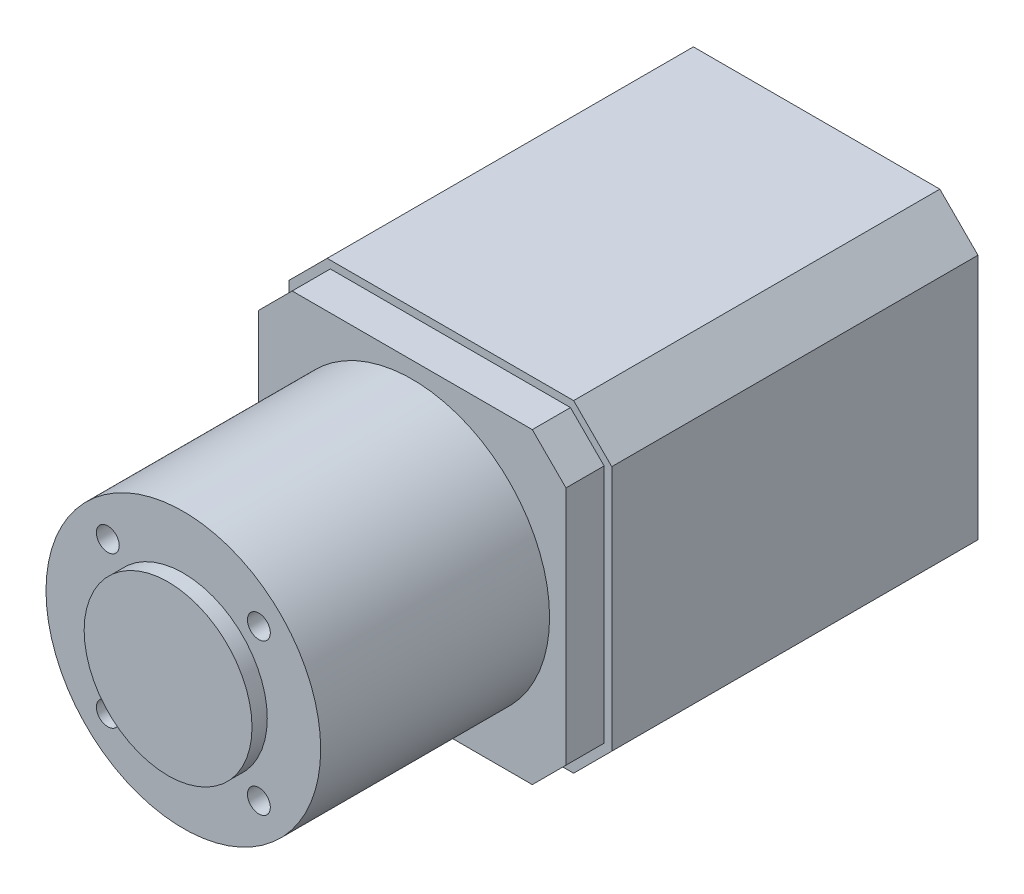
ISO-10303-21;
HEADER;
FILE_DESCRIPTION(('STEP AP214'),'2;1');
FILE_NAME('part.step','',(''),(''),'','','');
FILE_SCHEMA(('AUTOMOTIVE_DESIGN { 1 0 10303 214 1 1 1 1 }'));
ENDSEC;
DATA;
#1=APPLICATION_CONTEXT('core data for automotive mechanical design processes');
#2=APPLICATION_PROTOCOL_DEFINITION('international standard','automotive_design',2000,#1);
#3=PRODUCT_CONTEXT('',#1,'mechanical');
#4=PRODUCT('Part','Part','',(#3));
#5=PRODUCT_RELATED_PRODUCT_CATEGORY('part','',(#4));
#6=PRODUCT_DEFINITION_FORMATION('','',#4);
#7=PRODUCT_DEFINITION_CONTEXT('part definition',#1,'design');
#8=PRODUCT_DEFINITION('design','',#6,#7);
#9=PRODUCT_DEFINITION_SHAPE('','',#8);
#10=(LENGTH_UNIT() NAMED_UNIT(*) SI_UNIT(.MILLI.,.METRE.));
#11=(NAMED_UNIT(*) PLANE_ANGLE_UNIT() SI_UNIT($,.RADIAN.));
#12=(NAMED_UNIT(*) SI_UNIT($,.STERADIAN.) SOLID_ANGLE_UNIT());
#13=UNCERTAINTY_MEASURE_WITH_UNIT(LENGTH_MEASURE(1.E-05),#10,'distance_accuracy_value','');
#14=(GEOMETRIC_REPRESENTATION_CONTEXT(3) GLOBAL_UNCERTAINTY_ASSIGNED_CONTEXT((#13)) GLOBAL_UNIT_ASSIGNED_CONTEXT((#10,
#11,#12)) REPRESENTATION_CONTEXT('',''));
#15=CARTESIAN_POINT('',(0.,0.,0.));
#16=DIRECTION('',(0.,0.,1.));
#17=DIRECTION('',(1.,0.,0.));
#18=AXIS2_PLACEMENT_3D('',#15,#16,#17);
#19=CARTESIAN_POINT('',(-21.15,-21.15,48.));
#20=DIRECTION('',(1.,0.,0.));
#21=DIRECTION('',(0.,0.,-1.));
#22=AXIS2_PLACEMENT_3D('',#19,#20,#21);
#23=PLANE('',#22);
#24=DIRECTION('',(0.,-1.,0.));
#25=VECTOR('',#24,1.);
#26=CARTESIAN_POINT('',(-21.15,-21.15,0.));
#27=LINE('',#26,#25);
#28=CARTESIAN_POINT('',(-21.15,16.15,0.));
#29=VERTEX_POINT('',#28);
#30=CARTESIAN_POINT('',(-21.15,-16.15,0.));
#31=VERTEX_POINT('',#30);
#32=EDGE_CURVE('E170',#29,#31,#27,.T.);
#33=ORIENTED_EDGE('',*,*,#32,.T.);
#34=DIRECTION('',(0.,0.,1.));
#35=VECTOR('',#34,1.);
#36=CARTESIAN_POINT('',(-21.15,-16.15,48.));
#37=LINE('',#36,#35);
#38=CARTESIAN_POINT('',(-21.15,-16.15,48.));
#39=VERTEX_POINT('',#38);
#40=EDGE_CURVE('E215',#31,#39,#37,.T.);
#41=ORIENTED_EDGE('',*,*,#40,.T.);
#42=DIRECTION('',(0.,-1.,0.));
#43=VECTOR('',#42,1.);
#44=CARTESIAN_POINT('',(-21.15,-21.15,48.));
#45=LINE('',#44,#43);
#46=CARTESIAN_POINT('',(-21.15,16.15,48.));
#47=VERTEX_POINT('',#46);
#48=EDGE_CURVE('E179',#47,#39,#45,.T.);
#49=ORIENTED_EDGE('',*,*,#48,.F.);
#50=DIRECTION('',(0.,0.,-1.));
#51=VECTOR('',#50,1.);
#52=CARTESIAN_POINT('',(-21.15,16.15,48.));
#53=LINE('',#52,#51);
#54=EDGE_CURVE('E212',#47,#29,#53,.T.);
#55=ORIENTED_EDGE('',*,*,#54,.T.);
#56=EDGE_LOOP('',(#33,#41,#49,#55));
#57=FACE_BOUND('',#56,.T.);
#58=ADVANCED_FACE('F34',(#57),#23,.F.);
#59=CARTESIAN_POINT('',(21.15,-21.15,48.));
#60=DIRECTION('',(0.,1.,0.));
#61=DIRECTION('',(-1.,0.,0.));
#62=AXIS2_PLACEMENT_3D('',#59,#60,#61);
#63=PLANE('',#62);
#64=DIRECTION('',(1.,0.,0.));
#65=VECTOR('',#64,1.);
#66=CARTESIAN_POINT('',(21.15,-21.15,48.));
#67=LINE('',#66,#65);
#68=CARTESIAN_POINT('',(-16.15,-21.15,48.));
#69=VERTEX_POINT('',#68);
#70=CARTESIAN_POINT('',(16.15,-21.15,48.));
#71=VERTEX_POINT('',#70);
#72=EDGE_CURVE('E182',#69,#71,#67,.T.);
#73=ORIENTED_EDGE('',*,*,#72,.F.);
#74=DIRECTION('',(0.,0.,-1.));
#75=VECTOR('',#74,1.);
#76=CARTESIAN_POINT('',(-16.15,-21.15,48.));
#77=LINE('',#76,#75);
#78=CARTESIAN_POINT('',(-16.15,-21.15,0.));
#79=VERTEX_POINT('',#78);
#80=EDGE_CURVE('E201',#69,#79,#77,.T.);
#81=ORIENTED_EDGE('',*,*,#80,.T.);
#82=DIRECTION('',(1.,0.,0.));
#83=VECTOR('',#82,1.);
#84=CARTESIAN_POINT('',(21.15,-21.15,0.));
#85=LINE('',#84,#83);
#86=CARTESIAN_POINT('',(16.15,-21.15,0.));
#87=VERTEX_POINT('',#86);
#88=EDGE_CURVE('E173',#79,#87,#85,.T.);
#89=ORIENTED_EDGE('',*,*,#88,.T.);
#90=DIRECTION('',(0.,0.,1.));
#91=VECTOR('',#90,1.);
#92=CARTESIAN_POINT('',(16.15,-21.15,48.));
#93=LINE('',#92,#91);
#94=EDGE_CURVE('E191',#87,#71,#93,.T.);
#95=ORIENTED_EDGE('',*,*,#94,.T.);
#96=EDGE_LOOP('',(#73,#81,#89,#95));
#97=FACE_BOUND('',#96,.T.);
#98=ADVANCED_FACE('F319',(#97),#63,.F.);
#99=CARTESIAN_POINT('',(21.15,-21.15,48.));
#100=DIRECTION('',(-1.,0.,0.));
#101=DIRECTION('',(0.,0.,1.));
#102=AXIS2_PLACEMENT_3D('',#99,#100,#101);
#103=PLANE('',#102);
#104=DIRECTION('',(0.,1.,0.));
#105=VECTOR('',#104,1.);
#106=CARTESIAN_POINT('',(21.15,-21.15,48.));
#107=LINE('',#106,#105);
#108=CARTESIAN_POINT('',(21.15,-16.15,48.));
#109=VERTEX_POINT('',#108);
#110=CARTESIAN_POINT('',(21.15,16.15,48.));
#111=VERTEX_POINT('',#110);
#112=EDGE_CURVE('E186',#109,#111,#107,.T.);
#113=ORIENTED_EDGE('',*,*,#112,.F.);
#114=DIRECTION('',(0.,0.,-1.));
#115=VECTOR('',#114,1.);
#116=CARTESIAN_POINT('',(21.15,-16.15,48.));
#117=LINE('',#116,#115);
#118=CARTESIAN_POINT('',(21.15,-16.15,0.));
#119=VERTEX_POINT('',#118);
#120=EDGE_CURVE('E227',#109,#119,#117,.T.);
#121=ORIENTED_EDGE('',*,*,#120,.T.);
#122=DIRECTION('',(0.,1.,0.));
#123=VECTOR('',#122,1.);
#124=CARTESIAN_POINT('',(21.15,-21.15,0.));
#125=LINE('',#124,#123);
#126=CARTESIAN_POINT('',(21.15,16.15,0.));
#127=VERTEX_POINT('',#126);
#128=EDGE_CURVE('E195',#119,#127,#125,.T.);
#129=ORIENTED_EDGE('',*,*,#128,.T.);
#130=DIRECTION('',(0.,0.,1.));
#131=VECTOR('',#130,1.);
#132=CARTESIAN_POINT('',(21.15,16.15,48.));
#133=LINE('',#132,#131);
#134=EDGE_CURVE('E225',#127,#111,#133,.T.);
#135=ORIENTED_EDGE('',*,*,#134,.T.);
#136=EDGE_LOOP('',(#113,#121,#129,#135));
#137=FACE_BOUND('',#136,.T.);
#138=ADVANCED_FACE('F325',(#137),#103,.F.);
#139=CARTESIAN_POINT('',(21.15,21.15,48.));
#140=DIRECTION('',(0.,-1.,0.));
#141=DIRECTION('',(1.,0.,0.));
#142=AXIS2_PLACEMENT_3D('',#139,#140,#141);
#143=PLANE('',#142);
#144=DIRECTION('',(-1.,0.,0.));
#145=VECTOR('',#144,1.);
#146=CARTESIAN_POINT('',(21.15,21.15,48.));
#147=LINE('',#146,#145);
#148=CARTESIAN_POINT('',(16.15,21.15,48.));
#149=VERTEX_POINT('',#148);
#150=CARTESIAN_POINT('',(-16.15,21.15,48.));
#151=VERTEX_POINT('',#150);
#152=EDGE_CURVE('E189',#149,#151,#147,.T.);
#153=ORIENTED_EDGE('',*,*,#152,.F.);
#154=DIRECTION('',(0.,0.,-1.));
#155=VECTOR('',#154,1.);
#156=CARTESIAN_POINT('',(16.15,21.15,48.));
#157=LINE('',#156,#155);
#158=CARTESIAN_POINT('',(16.15,21.15,0.));
#159=VERTEX_POINT('',#158);
#160=EDGE_CURVE('E39',#149,#159,#157,.T.);
#161=ORIENTED_EDGE('',*,*,#160,.T.);
#162=DIRECTION('',(-1.,0.,0.));
#163=VECTOR('',#162,1.);
#164=CARTESIAN_POINT('',(21.15,21.15,0.));
#165=LINE('',#164,#163);
#166=CARTESIAN_POINT('',(-16.15,21.15,0.));
#167=VERTEX_POINT('',#166);
#168=EDGE_CURVE('E183',#159,#167,#165,.T.);
#169=ORIENTED_EDGE('',*,*,#168,.T.);
#170=DIRECTION('',(0.,0.,1.));
#171=VECTOR('',#170,1.);
#172=CARTESIAN_POINT('',(-16.15,21.15,48.));
#173=LINE('',#172,#171);
#174=EDGE_CURVE('E229',#167,#151,#173,.T.);
#175=ORIENTED_EDGE('',*,*,#174,.T.);
#176=EDGE_LOOP('',(#153,#161,#169,#175));
#177=FACE_BOUND('',#176,.T.);
#178=ADVANCED_FACE('F358',(#177),#143,.F.);
#179=CARTESIAN_POINT('',(0.,0.,48.));
#180=DIRECTION('',(0.,0.,1.));
#181=DIRECTION('',(1.,0.,0.));
#182=AXIS2_PLACEMENT_3D('',#179,#180,#181);
#183=PLANE('',#182);
#184=DIRECTION('',(-0.707106781186547,-0.707106781186548,0.));
#185=VECTOR('',#184,1.);
#186=CARTESIAN_POINT('',(-15.7357864376269,20.15,48.));
#187=LINE('',#186,#185);
#188=CARTESIAN_POINT('',(-15.7357864376269,20.15,48.));
#189=VERTEX_POINT('',#188);
#190=CARTESIAN_POINT('',(-20.15,15.7357864376269,48.));
#191=VERTEX_POINT('',#190);
#192=EDGE_CURVE('E52',#189,#191,#187,.T.);
#193=ORIENTED_EDGE('',*,*,#192,.F.);
#194=DIRECTION('',(-1.,0.,0.));
#195=VECTOR('',#194,1.);
#196=CARTESIAN_POINT('',(15.7357864376269,20.15,48.));
#197=LINE('',#196,#195);
#198=CARTESIAN_POINT('',(15.7357864376269,20.15,48.));
#199=VERTEX_POINT('',#198);
#200=EDGE_CURVE('E56',#199,#189,#197,.T.);
#201=ORIENTED_EDGE('',*,*,#200,.F.);
#202=DIRECTION('',(-0.707106781186546,0.707106781186549,0.));
#203=VECTOR('',#202,1.);
#204=CARTESIAN_POINT('',(20.15,15.7357864376269,48.));
#205=LINE('',#204,#203);
#206=CARTESIAN_POINT('',(20.15,15.7357864376269,48.));
#207=VERTEX_POINT('',#206);
#208=EDGE_CURVE('E269',#207,#199,#205,.T.);
#209=ORIENTED_EDGE('',*,*,#208,.F.);
#210=DIRECTION('',(0.,1.,0.));
#211=VECTOR('',#210,1.);
#212=CARTESIAN_POINT('',(20.15,-15.7357864376269,48.));
#213=LINE('',#212,#211);
#214=CARTESIAN_POINT('',(20.15,-15.7357864376269,48.));
#215=VERTEX_POINT('',#214);
#216=EDGE_CURVE('E266',#215,#207,#213,.T.);
#217=ORIENTED_EDGE('',*,*,#216,.F.);
#218=DIRECTION('',(0.707106781186549,0.707106781186546,0.));
#219=VECTOR('',#218,1.);
#220=CARTESIAN_POINT('',(15.7357864376269,-20.15,48.));
#221=LINE('',#220,#219);
#222=CARTESIAN_POINT('',(15.7357864376269,-20.15,48.));
#223=VERTEX_POINT('',#222);
#224=EDGE_CURVE('E263',#223,#215,#221,.T.);
#225=ORIENTED_EDGE('',*,*,#224,.F.);
#226=DIRECTION('',(1.,0.,0.));
#227=VECTOR('',#226,1.);
#228=CARTESIAN_POINT('',(-15.7357864376269,-20.15,48.));
#229=LINE('',#228,#227);
#230=CARTESIAN_POINT('',(-15.7357864376269,-20.15,48.));
#231=VERTEX_POINT('',#230);
#232=EDGE_CURVE('E260',#231,#223,#229,.T.);
#233=ORIENTED_EDGE('',*,*,#232,.F.);
#234=DIRECTION('',(0.707106781186547,-0.707106781186548,0.));
#235=VECTOR('',#234,1.);
#236=CARTESIAN_POINT('',(-20.15,-15.7357864376269,48.));
#237=LINE('',#236,#235);
#238=CARTESIAN_POINT('',(-20.15,-15.7357864376269,48.));
#239=VERTEX_POINT('',#238);
#240=EDGE_CURVE('E257',#239,#231,#237,.T.);
#241=ORIENTED_EDGE('',*,*,#240,.F.);
#242=DIRECTION('',(0.,-1.,0.));
#243=VECTOR('',#242,1.);
#244=CARTESIAN_POINT('',(-20.15,15.7357864376269,48.));
#245=LINE('',#244,#243);
#246=EDGE_CURVE('E255',#191,#239,#245,.T.);
#247=ORIENTED_EDGE('',*,*,#246,.F.);
#248=EDGE_LOOP('',(#193,#201,#209,#217,#225,#233,#241,#247));
#249=FACE_BOUND('',#248,.T.);
#250=ORIENTED_EDGE('',*,*,#48,.T.);
#251=DIRECTION('',(-0.707106781186547,0.707106781186549,0.));
#252=VECTOR('',#251,1.);
#253=CARTESIAN_POINT('',(-18.65,-18.65,48.));
#254=LINE('',#253,#252);
#255=EDGE_CURVE('E223',#39,#69,#254,.F.);
#256=ORIENTED_EDGE('',*,*,#255,.T.);
#257=ORIENTED_EDGE('',*,*,#72,.T.);
#258=DIRECTION('',(-0.707106781186549,-0.707106781186546,0.));
#259=VECTOR('',#258,1.);
#260=CARTESIAN_POINT('',(18.65,-18.65,48.));
#261=LINE('',#260,#259);
#262=EDGE_CURVE('E221',#71,#109,#261,.F.);
#263=ORIENTED_EDGE('',*,*,#262,.T.);
#264=ORIENTED_EDGE('',*,*,#112,.T.);
#265=DIRECTION('',(0.707106781186546,-0.707106781186549,0.));
#266=VECTOR('',#265,1.);
#267=CARTESIAN_POINT('',(18.65,18.65,48.));
#268=LINE('',#267,#266);
#269=EDGE_CURVE('E219',#111,#149,#268,.F.);
#270=ORIENTED_EDGE('',*,*,#269,.T.);
#271=ORIENTED_EDGE('',*,*,#152,.T.);
#272=DIRECTION('',(0.707106781186548,0.707106781186547,0.));
#273=VECTOR('',#272,1.);
#274=CARTESIAN_POINT('',(-18.65,18.65,48.));
#275=LINE('',#274,#273);
#276=EDGE_CURVE('E217',#151,#47,#275,.F.);
#277=ORIENTED_EDGE('',*,*,#276,.T.);
#278=EDGE_LOOP('',(#250,#256,#257,#263,#264,#270,#271,#277));
#279=FACE_BOUND('',#278,.T.);
#280=ADVANCED_FACE('F292',(#249,#279),#183,.T.);
#281=CARTESIAN_POINT('',(0.,0.,0.));
#282=DIRECTION('',(0.,0.,1.));
#283=DIRECTION('',(1.,0.,0.));
#284=AXIS2_PLACEMENT_3D('',#281,#282,#283);
#285=PLANE('',#284);
#286=ORIENTED_EDGE('',*,*,#88,.F.);
#287=DIRECTION('',(0.707106781186547,-0.707106781186549,0.));
#288=VECTOR('',#287,1.);
#289=CARTESIAN_POINT('',(-16.15,-21.15,0.));
#290=LINE('',#289,#288);
#291=EDGE_CURVE('E210',#79,#31,#290,.F.);
#292=ORIENTED_EDGE('',*,*,#291,.T.);
#293=ORIENTED_EDGE('',*,*,#32,.F.);
#294=DIRECTION('',(-0.707106781186548,-0.707106781186547,0.));
#295=VECTOR('',#294,1.);
#296=CARTESIAN_POINT('',(-21.15,16.15,0.));
#297=LINE('',#296,#295);
#298=EDGE_CURVE('E204',#29,#167,#297,.F.);
#299=ORIENTED_EDGE('',*,*,#298,.T.);
#300=ORIENTED_EDGE('',*,*,#168,.F.);
#301=DIRECTION('',(-0.707106781186546,0.707106781186549,0.));
#302=VECTOR('',#301,1.);
#303=CARTESIAN_POINT('',(16.15,21.15,0.));
#304=LINE('',#303,#302);
#305=EDGE_CURVE('E206',#159,#127,#304,.F.);
#306=ORIENTED_EDGE('',*,*,#305,.T.);
#307=ORIENTED_EDGE('',*,*,#128,.F.);
#308=DIRECTION('',(0.707106781186549,0.707106781186546,0.));
#309=VECTOR('',#308,1.);
#310=CARTESIAN_POINT('',(21.15,-16.15,0.));
#311=LINE('',#310,#309);
#312=EDGE_CURVE('E208',#119,#87,#311,.F.);
#313=ORIENTED_EDGE('',*,*,#312,.T.);
#314=EDGE_LOOP('',(#286,#292,#293,#299,#300,#306,#307,#313));
#315=FACE_BOUND('',#314,.T.);
#316=ADVANCED_FACE('F338',(#315),#285,.F.);
#317=CARTESIAN_POINT('',(-16.15,-21.15,48.));
#318=DIRECTION('',(0.707106781186548,0.707106781186546,0.));
#319=DIRECTION('',(0.,0.,-1.));
#320=AXIS2_PLACEMENT_3D('',#317,#318,#319);
#321=PLANE('',#320);
#322=ORIENTED_EDGE('',*,*,#255,.F.);
#323=ORIENTED_EDGE('',*,*,#40,.F.);
#324=ORIENTED_EDGE('',*,*,#291,.F.);
#325=ORIENTED_EDGE('',*,*,#80,.F.);
#326=EDGE_LOOP('',(#322,#323,#324,#325));
#327=FACE_BOUND('',#326,.T.);
#328=ADVANCED_FACE('F331',(#327),#321,.F.);
#329=CARTESIAN_POINT('',(21.15,-16.15,48.));
#330=DIRECTION('',(-0.707106781186546,0.707106781186549,0.));
#331=DIRECTION('',(0.,0.,-1.));
#332=AXIS2_PLACEMENT_3D('',#329,#330,#331);
#333=PLANE('',#332);
#334=ORIENTED_EDGE('',*,*,#262,.F.);
#335=ORIENTED_EDGE('',*,*,#94,.F.);
#336=ORIENTED_EDGE('',*,*,#312,.F.);
#337=ORIENTED_EDGE('',*,*,#120,.F.);
#338=EDGE_LOOP('',(#334,#335,#336,#337));
#339=FACE_BOUND('',#338,.T.);
#340=ADVANCED_FACE('F337',(#339),#333,.F.);
#341=CARTESIAN_POINT('',(16.15,21.15,48.));
#342=DIRECTION('',(-0.707106781186549,-0.707106781186546,0.));
#343=DIRECTION('',(0.,0.,-1.));
#344=AXIS2_PLACEMENT_3D('',#341,#342,#343);
#345=PLANE('',#344);
#346=ORIENTED_EDGE('',*,*,#269,.F.);
#347=ORIENTED_EDGE('',*,*,#134,.F.);
#348=ORIENTED_EDGE('',*,*,#305,.F.);
#349=ORIENTED_EDGE('',*,*,#160,.F.);
#350=EDGE_LOOP('',(#346,#347,#348,#349));
#351=FACE_BOUND('',#350,.T.);
#352=ADVANCED_FACE('F344',(#351),#345,.F.);
#353=CARTESIAN_POINT('',(-21.15,16.15,48.));
#354=DIRECTION('',(0.707106781186547,-0.707106781186548,0.));
#355=DIRECTION('',(0.,0.,-1.));
#356=AXIS2_PLACEMENT_3D('',#353,#354,#355);
#357=PLANE('',#356);
#358=ORIENTED_EDGE('',*,*,#276,.F.);
#359=ORIENTED_EDGE('',*,*,#174,.F.);
#360=ORIENTED_EDGE('',*,*,#298,.F.);
#361=ORIENTED_EDGE('',*,*,#54,.F.);
#362=EDGE_LOOP('',(#358,#359,#360,#361));
#363=FACE_BOUND('',#362,.T.);
#364=ADVANCED_FACE('F37',(#363),#357,.F.);
#365=CARTESIAN_POINT('',(-15.7357864376269,20.15,53.));
#366=DIRECTION('',(0.707106781186548,-0.707106781186547,0.));
#367=DIRECTION('',(0.707106781186547,0.707106781186548,0.));
#368=AXIS2_PLACEMENT_3D('',#365,#366,#367);
#369=PLANE('',#368);
#370=ORIENTED_EDGE('',*,*,#192,.T.);
#371=DIRECTION('',(0.,0.,-1.));
#372=VECTOR('',#371,1.);
#373=CARTESIAN_POINT('',(-20.15,15.7357864376269,53.));
#374=LINE('',#373,#372);
#375=CARTESIAN_POINT('',(-20.15,15.7357864376269,53.));
#376=VERTEX_POINT('',#375);
#377=EDGE_CURVE('E153',#376,#191,#374,.T.);
#378=ORIENTED_EDGE('',*,*,#377,.F.);
#379=DIRECTION('',(-0.707106781186547,-0.707106781186548,0.));
#380=VECTOR('',#379,1.);
#381=CARTESIAN_POINT('',(-15.7357864376269,20.15,53.));
#382=LINE('',#381,#380);
#383=CARTESIAN_POINT('',(-15.7357864376269,20.15,53.));
#384=VERTEX_POINT('',#383);
#385=EDGE_CURVE('E159',#384,#376,#382,.T.);
#386=ORIENTED_EDGE('',*,*,#385,.F.);
#387=DIRECTION('',(0.,0.,-1.));
#388=VECTOR('',#387,1.);
#389=CARTESIAN_POINT('',(-15.7357864376269,20.15,53.));
#390=LINE('',#389,#388);
#391=EDGE_CURVE('E253',#384,#189,#390,.T.);
#392=ORIENTED_EDGE('',*,*,#391,.T.);
#393=EDGE_LOOP('',(#370,#378,#386,#392));
#394=FACE_BOUND('',#393,.T.);
#395=ADVANCED_FACE('F169',(#394),#369,.F.);
#396=CARTESIAN_POINT('',(-20.15,15.7357864376269,53.));
#397=DIRECTION('',(1.,0.,0.));
#398=DIRECTION('',(0.,0.,-1.));
#399=AXIS2_PLACEMENT_3D('',#396,#397,#398);
#400=PLANE('',#399);
#401=ORIENTED_EDGE('',*,*,#246,.T.);
#402=DIRECTION('',(0.,0.,-1.));
#403=VECTOR('',#402,1.);
#404=CARTESIAN_POINT('',(-20.15,-15.7357864376269,53.));
#405=LINE('',#404,#403);
#406=CARTESIAN_POINT('',(-20.15,-15.7357864376269,53.));
#407=VERTEX_POINT('',#406);
#408=EDGE_CURVE('E155',#407,#239,#405,.T.);
#409=ORIENTED_EDGE('',*,*,#408,.F.);
#410=DIRECTION('',(0.,-1.,0.));
#411=VECTOR('',#410,1.);
#412=CARTESIAN_POINT('',(-20.15,15.7357864376269,53.));
#413=LINE('',#412,#411);
#414=EDGE_CURVE('E148',#376,#407,#413,.T.);
#415=ORIENTED_EDGE('',*,*,#414,.F.);
#416=ORIENTED_EDGE('',*,*,#377,.T.);
#417=EDGE_LOOP('',(#401,#409,#415,#416));
#418=FACE_BOUND('',#417,.T.);
#419=ADVANCED_FACE('F151',(#418),#400,.F.);
#420=CARTESIAN_POINT('',(-20.15,-15.7357864376269,53.));
#421=DIRECTION('',(0.707106781186548,0.707106781186547,0.));
#422=DIRECTION('',(-0.707106781186547,0.707106781186548,0.));
#423=AXIS2_PLACEMENT_3D('',#420,#421,#422);
#424=PLANE('',#423);
#425=ORIENTED_EDGE('',*,*,#240,.T.);
#426=DIRECTION('',(0.,0.,-1.));
#427=VECTOR('',#426,1.);
#428=CARTESIAN_POINT('',(-15.7357864376269,-20.15,53.));
#429=LINE('',#428,#427);
#430=CARTESIAN_POINT('',(-15.7357864376269,-20.15,53.));
#431=VERTEX_POINT('',#430);
#432=EDGE_CURVE('E175',#431,#231,#429,.T.);
#433=ORIENTED_EDGE('',*,*,#432,.F.);
#434=DIRECTION('',(0.707106781186547,-0.707106781186548,0.));
#435=VECTOR('',#434,1.);
#436=CARTESIAN_POINT('',(-20.15,-15.7357864376269,53.));
#437=LINE('',#436,#435);
#438=EDGE_CURVE('E158',#407,#431,#437,.T.);
#439=ORIENTED_EDGE('',*,*,#438,.F.);
#440=ORIENTED_EDGE('',*,*,#408,.T.);
#441=EDGE_LOOP('',(#425,#433,#439,#440));
#442=FACE_BOUND('',#441,.T.);
#443=ADVANCED_FACE('F291',(#442),#424,.F.);
#444=CARTESIAN_POINT('',(-15.7357864376269,-20.15,53.));
#445=DIRECTION('',(0.,1.,0.));
#446=DIRECTION('',(-1.,0.,0.));
#447=AXIS2_PLACEMENT_3D('',#444,#445,#446);
#448=PLANE('',#447);
#449=ORIENTED_EDGE('',*,*,#232,.T.);
#450=DIRECTION('',(0.,0.,-1.));
#451=VECTOR('',#450,1.);
#452=CARTESIAN_POINT('',(15.7357864376269,-20.15,53.));
#453=LINE('',#452,#451);
#454=CARTESIAN_POINT('',(15.7357864376269,-20.15,53.));
#455=VERTEX_POINT('',#454);
#456=EDGE_CURVE('E282',#455,#223,#453,.T.);
#457=ORIENTED_EDGE('',*,*,#456,.F.);
#458=DIRECTION('',(1.,0.,0.));
#459=VECTOR('',#458,1.);
#460=CARTESIAN_POINT('',(-15.7357864376269,-20.15,53.));
#461=LINE('',#460,#459);
#462=EDGE_CURVE('E244',#431,#455,#461,.T.);
#463=ORIENTED_EDGE('',*,*,#462,.F.);
#464=ORIENTED_EDGE('',*,*,#432,.T.);
#465=EDGE_LOOP('',(#449,#457,#463,#464));
#466=FACE_BOUND('',#465,.T.);
#467=ADVANCED_FACE('F288',(#466),#448,.F.);
#468=CARTESIAN_POINT('',(15.7357864376269,-20.15,53.));
#469=DIRECTION('',(-0.707106781186546,0.707106781186549,0.));
#470=DIRECTION('',(-0.707106781186549,-0.707106781186546,0.));
#471=AXIS2_PLACEMENT_3D('',#468,#469,#470);
#472=PLANE('',#471);
#473=ORIENTED_EDGE('',*,*,#224,.T.);
#474=DIRECTION('',(0.,0.,-1.));
#475=VECTOR('',#474,1.);
#476=CARTESIAN_POINT('',(20.15,-15.7357864376269,53.));
#477=LINE('',#476,#475);
#478=CARTESIAN_POINT('',(20.15,-15.7357864376269,53.));
#479=VERTEX_POINT('',#478);
#480=EDGE_CURVE('E279',#479,#215,#477,.T.);
#481=ORIENTED_EDGE('',*,*,#480,.F.);
#482=DIRECTION('',(0.707106781186549,0.707106781186546,0.));
#483=VECTOR('',#482,1.);
#484=CARTESIAN_POINT('',(15.7357864376269,-20.15,53.));
#485=LINE('',#484,#483);
#486=EDGE_CURVE('E246',#455,#479,#485,.T.);
#487=ORIENTED_EDGE('',*,*,#486,.F.);
#488=ORIENTED_EDGE('',*,*,#456,.T.);
#489=EDGE_LOOP('',(#473,#481,#487,#488));
#490=FACE_BOUND('',#489,.T.);
#491=ADVANCED_FACE('F296',(#490),#472,.F.);
#492=CARTESIAN_POINT('',(20.15,-15.7357864376269,53.));
#493=DIRECTION('',(-1.,0.,0.));
#494=DIRECTION('',(0.,0.,1.));
#495=AXIS2_PLACEMENT_3D('',#492,#493,#494);
#496=PLANE('',#495);
#497=ORIENTED_EDGE('',*,*,#216,.T.);
#498=DIRECTION('',(0.,0.,-1.));
#499=VECTOR('',#498,1.);
#500=CARTESIAN_POINT('',(20.15,15.7357864376269,53.));
#501=LINE('',#500,#499);
#502=CARTESIAN_POINT('',(20.15,15.7357864376269,53.));
#503=VERTEX_POINT('',#502);
#504=EDGE_CURVE('E276',#503,#207,#501,.T.);
#505=ORIENTED_EDGE('',*,*,#504,.F.);
#506=DIRECTION('',(0.,1.,0.));
#507=VECTOR('',#506,1.);
#508=CARTESIAN_POINT('',(20.15,-15.7357864376269,53.));
#509=LINE('',#508,#507);
#510=EDGE_CURVE('E248',#479,#503,#509,.T.);
#511=ORIENTED_EDGE('',*,*,#510,.F.);
#512=ORIENTED_EDGE('',*,*,#480,.T.);
#513=EDGE_LOOP('',(#497,#505,#511,#512));
#514=FACE_BOUND('',#513,.T.);
#515=ADVANCED_FACE('F300',(#514),#496,.F.);
#516=CARTESIAN_POINT('',(20.15,15.7357864376269,53.));
#517=DIRECTION('',(-0.707106781186549,-0.707106781186546,0.));
#518=DIRECTION('',(0.707106781186546,-0.707106781186549,0.));
#519=AXIS2_PLACEMENT_3D('',#516,#517,#518);
#520=PLANE('',#519);
#521=ORIENTED_EDGE('',*,*,#208,.T.);
#522=DIRECTION('',(0.,0.,-1.));
#523=VECTOR('',#522,1.);
#524=CARTESIAN_POINT('',(15.7357864376269,20.15,53.));
#525=LINE('',#524,#523);
#526=CARTESIAN_POINT('',(15.7357864376269,20.15,53.));
#527=VERTEX_POINT('',#526);
#528=EDGE_CURVE('E273',#527,#199,#525,.T.);
#529=ORIENTED_EDGE('',*,*,#528,.F.);
#530=DIRECTION('',(-0.707106781186546,0.707106781186549,0.));
#531=VECTOR('',#530,1.);
#532=CARTESIAN_POINT('',(20.15,15.7357864376269,53.));
#533=LINE('',#532,#531);
#534=EDGE_CURVE('E250',#503,#527,#533,.T.);
#535=ORIENTED_EDGE('',*,*,#534,.F.);
#536=ORIENTED_EDGE('',*,*,#504,.T.);
#537=EDGE_LOOP('',(#521,#529,#535,#536));
#538=FACE_BOUND('',#537,.T.);
#539=ADVANCED_FACE('F305',(#538),#520,.F.);
#540=CARTESIAN_POINT('',(15.7357864376269,20.15,53.));
#541=DIRECTION('',(0.,-1.,0.));
#542=DIRECTION('',(1.,0.,0.));
#543=AXIS2_PLACEMENT_3D('',#540,#541,#542);
#544=PLANE('',#543);
#545=ORIENTED_EDGE('',*,*,#200,.T.);
#546=ORIENTED_EDGE('',*,*,#391,.F.);
#547=DIRECTION('',(-1.,0.,0.));
#548=VECTOR('',#547,1.);
#549=CARTESIAN_POINT('',(15.7357864376269,20.15,53.));
#550=LINE('',#549,#548);
#551=EDGE_CURVE('E164',#527,#384,#550,.T.);
#552=ORIENTED_EDGE('',*,*,#551,.F.);
#553=ORIENTED_EDGE('',*,*,#528,.T.);
#554=EDGE_LOOP('',(#545,#546,#552,#553));
#555=FACE_BOUND('',#554,.T.);
#556=ADVANCED_FACE('F307',(#555),#544,.F.);
#557=CARTESIAN_POINT('',(0.,0.,53.));
#558=DIRECTION('',(0.,0.,1.));
#559=DIRECTION('',(1.,0.,0.));
#560=AXIS2_PLACEMENT_3D('',#557,#558,#559);
#561=PLANE('',#560);
#562=CARTESIAN_POINT('',(0.,0.,53.));
#563=DIRECTION('',(0.,0.,1.));
#564=DIRECTION('',(1.,0.,0.));
#565=AXIS2_PLACEMENT_3D('',#562,#563,#564);
#566=CIRCLE('',#565,18.);
#567=CARTESIAN_POINT('',(18.,0.,53.));
#568=VERTEX_POINT('',#567);
#569=EDGE_CURVE('E44',#568,#568,#566,.T.);
#570=ORIENTED_EDGE('',*,*,#569,.F.);
#571=EDGE_LOOP('',(#570));
#572=FACE_BOUND('',#571,.T.);
#573=ORIENTED_EDGE('',*,*,#385,.T.);
#574=ORIENTED_EDGE('',*,*,#414,.T.);
#575=ORIENTED_EDGE('',*,*,#438,.T.);
#576=ORIENTED_EDGE('',*,*,#462,.T.);
#577=ORIENTED_EDGE('',*,*,#486,.T.);
#578=ORIENTED_EDGE('',*,*,#510,.T.);
#579=ORIENTED_EDGE('',*,*,#534,.T.);
#580=ORIENTED_EDGE('',*,*,#551,.T.);
#581=EDGE_LOOP('',(#573,#574,#575,#576,#577,#578,#579,#580));
#582=FACE_BOUND('',#581,.T.);
#583=ADVANCED_FACE('F162',(#572,#582),#561,.T.);
#584=CARTESIAN_POINT('',(0.,0.,83.));
#585=DIRECTION('',(0.,0.,-1.));
#586=DIRECTION('',(-1.,0.,0.));
#587=AXIS2_PLACEMENT_3D('',#584,#585,#586);
#588=CYLINDRICAL_SURFACE('',#587,18.);
#589=CARTESIAN_POINT('',(0.,0.,83.));
#590=DIRECTION('',(0.,0.,1.));
#591=DIRECTION('',(1.,0.,0.));
#592=AXIS2_PLACEMENT_3D('',#589,#590,#591);
#593=CIRCLE('',#592,18.);
#594=CARTESIAN_POINT('',(18.,0.,83.));
#595=VERTEX_POINT('',#594);
#596=EDGE_CURVE('E241',#595,#595,#593,.T.);
#597=ORIENTED_EDGE('',*,*,#596,.F.);
#598=EDGE_LOOP('',(#597));
#599=FACE_BOUND('',#598,.T.);
#600=ORIENTED_EDGE('',*,*,#569,.T.);
#601=EDGE_LOOP('',(#600));
#602=FACE_BOUND('',#601,.T.);
#603=ADVANCED_FACE('F314',(#599,#602),#588,.T.);
#604=CARTESIAN_POINT('',(0.,0.,83.));
#605=DIRECTION('',(0.,0.,1.));
#606=DIRECTION('',(1.,0.,0.));
#607=AXIS2_PLACEMENT_3D('',#604,#605,#606);
#608=PLANE('',#607);
#609=CARTESIAN_POINT('',(9.89949493661161,-9.89949493661172,83.));
#610=DIRECTION('',(0.,0.,1.));
#611=DIRECTION('',(0.,-1.,0.));
#612=AXIS2_PLACEMENT_3D('',#609,#610,#611);
#613=CIRCLE('',#612,1.5);
#614=CARTESIAN_POINT('',(9.89949493661161,-11.3994949366117,83.));
#615=VERTEX_POINT('',#614);
#616=EDGE_CURVE('E527',#615,#615,#613,.T.);
#617=ORIENTED_EDGE('',*,*,#616,.F.);
#618=EDGE_LOOP('',(#617));
#619=FACE_BOUND('',#618,.T.);
#620=CARTESIAN_POINT('',(-9.89949493661168,-9.89949493661165,83.));
#621=DIRECTION('',(0.,0.,1.));
#622=DIRECTION('',(-1.,0.,0.));
#623=AXIS2_PLACEMENT_3D('',#620,#621,#622);
#624=CIRCLE('',#623,1.5);
#625=CARTESIAN_POINT('',(-11.3994949366117,-9.89949493661165,83.));
#626=VERTEX_POINT('',#625);
#627=EDGE_CURVE('E536',#626,#626,#624,.T.);
#628=ORIENTED_EDGE('',*,*,#627,.F.);
#629=EDGE_LOOP('',(#628));
#630=FACE_BOUND('',#629,.T.);
#631=CARTESIAN_POINT('',(-9.89949493661154,9.89949493661179,83.));
#632=DIRECTION('',(0.,0.,1.));
#633=DIRECTION('',(0.,1.,0.));
#634=AXIS2_PLACEMENT_3D('',#631,#632,#633);
#635=CIRCLE('',#634,1.5);
#636=CARTESIAN_POINT('',(-9.89949493661153,11.3994949366118,83.));
#637=VERTEX_POINT('',#636);
#638=EDGE_CURVE('E542',#637,#637,#635,.T.);
#639=ORIENTED_EDGE('',*,*,#638,.F.);
#640=EDGE_LOOP('',(#639));
#641=FACE_BOUND('',#640,.T.);
#642=CARTESIAN_POINT('',(9.89949493661168,9.89949493661165,83.));
#643=DIRECTION('',(0.,0.,1.));
#644=DIRECTION('',(1.,0.,0.));
#645=AXIS2_PLACEMENT_3D('',#642,#643,#644);
#646=CIRCLE('',#645,1.5);
#647=CARTESIAN_POINT('',(11.3994949366117,9.89949493661165,83.));
#648=VERTEX_POINT('',#647);
#649=EDGE_CURVE('E526',#648,#648,#646,.T.);
#650=ORIENTED_EDGE('',*,*,#649,.F.);
#651=EDGE_LOOP('',(#650));
#652=FACE_BOUND('',#651,.T.);
#653=CARTESIAN_POINT('',(0.,0.,83.));
#654=DIRECTION('',(0.,0.,1.));
#655=DIRECTION('',(1.,0.,0.));
#656=AXIS2_PLACEMENT_3D('',#653,#654,#655);
#657=CIRCLE('',#656,11.);
#658=CARTESIAN_POINT('',(11.,0.,83.));
#659=VERTEX_POINT('',#658);
#660=EDGE_CURVE('E11',#659,#659,#657,.T.);
#661=ORIENTED_EDGE('',*,*,#660,.F.);
#662=EDGE_LOOP('',(#661));
#663=FACE_BOUND('',#662,.T.);
#664=ORIENTED_EDGE('',*,*,#596,.T.);
#665=EDGE_LOOP('',(#664));
#666=FACE_BOUND('',#665,.T.);
#667=ADVANCED_FACE('F409',(#619,#630,#641,#652,#663,#666),#608,.T.);
#668=CARTESIAN_POINT('',(0.,0.,85.));
#669=DIRECTION('',(0.,0.,-1.));
#670=DIRECTION('',(-1.,0.,0.));
#671=AXIS2_PLACEMENT_3D('',#668,#669,#670);
#672=CYLINDRICAL_SURFACE('',#671,11.);
#673=CARTESIAN_POINT('',(0.,0.,85.));
#674=DIRECTION('',(0.,0.,1.));
#675=DIRECTION('',(1.,0.,0.));
#676=AXIS2_PLACEMENT_3D('',#673,#674,#675);
#677=CIRCLE('',#676,11.);
#678=CARTESIAN_POINT('',(11.,0.,85.));
#679=VERTEX_POINT('',#678);
#680=EDGE_CURVE('E549',#679,#679,#677,.T.);
#681=ORIENTED_EDGE('',*,*,#680,.F.);
#682=EDGE_LOOP('',(#681));
#683=FACE_BOUND('',#682,.T.);
#684=ORIENTED_EDGE('',*,*,#660,.T.);
#685=EDGE_LOOP('',(#684));
#686=FACE_BOUND('',#685,.T.);
#687=ADVANCED_FACE('F417',(#683,#686),#672,.T.);
#688=CARTESIAN_POINT('',(0.,0.,85.));
#689=DIRECTION('',(0.,0.,1.));
#690=DIRECTION('',(1.,0.,0.));
#691=AXIS2_PLACEMENT_3D('',#688,#689,#690);
#692=PLANE('',#691);
#693=ORIENTED_EDGE('',*,*,#680,.T.);
#694=EDGE_LOOP('',(#693));
#695=FACE_BOUND('',#694,.T.);
#696=ADVANCED_FACE('F422',(#695),#692,.T.);
#697=CARTESIAN_POINT('',(9.89949493661168,9.89949493661165,48.7573593128807));
#698=DIRECTION('',(0.,0.,1.));
#699=DIRECTION('',(1.,0.,0.));
#700=AXIS2_PLACEMENT_3D('',#697,#698,#699);
#701=CYLINDRICAL_SURFACE('',#700,1.5);
#702=CARTESIAN_POINT('',(9.89949493661168,9.89949493661165,53.));
#703=DIRECTION('',(0.,0.,1.));
#704=DIRECTION('',(1.,0.,0.));
#705=AXIS2_PLACEMENT_3D('',#702,#703,#704);
#706=CIRCLE('',#705,1.5);
#707=CARTESIAN_POINT('',(11.3994949366117,9.89949493661165,53.));
#708=VERTEX_POINT('',#707);
#709=EDGE_CURVE('E530',#708,#708,#706,.F.);
#710=ORIENTED_EDGE('',*,*,#709,.T.);
#711=EDGE_LOOP('',(#710));
#712=FACE_BOUND('',#711,.T.);
#713=ORIENTED_EDGE('',*,*,#649,.T.);
#714=EDGE_LOOP('',(#713));
#715=FACE_BOUND('',#714,.T.);
#716=ADVANCED_FACE('F432',(#712,#715),#701,.F.);
#717=CARTESIAN_POINT('',(0.,0.,53.));
#718=DIRECTION('',(0.,0.,1.));
#719=DIRECTION('',(1.,0.,0.));
#720=AXIS2_PLACEMENT_3D('',#717,#718,#719);
#721=PLANE('',#720);
#722=ORIENTED_EDGE('',*,*,#709,.F.);
#723=EDGE_LOOP('',(#722));
#724=FACE_BOUND('',#723,.T.);
#725=ADVANCED_FACE('F442',(#724),#721,.T.);
#726=CARTESIAN_POINT('',(-9.89949493661154,9.89949493661179,48.7573593128807));
#727=DIRECTION('',(0.,0.,1.));
#728=DIRECTION('',(1.,0.,0.));
#729=AXIS2_PLACEMENT_3D('',#726,#727,#728);
#730=CYLINDRICAL_SURFACE('',#729,1.5);
#731=CARTESIAN_POINT('',(-9.89949493661154,9.89949493661179,53.));
#732=DIRECTION('',(0.,0.,1.));
#733=DIRECTION('',(1.,0.,0.));
#734=AXIS2_PLACEMENT_3D('',#731,#732,#733);
#735=CIRCLE('',#734,1.5);
#736=CARTESIAN_POINT('',(-8.39949493661155,9.89949493661179,53.));
#737=VERTEX_POINT('',#736);
#738=EDGE_CURVE('E539',#737,#737,#735,.F.);
#739=ORIENTED_EDGE('',*,*,#738,.T.);
#740=EDGE_LOOP('',(#739));
#741=FACE_BOUND('',#740,.T.);
#742=ORIENTED_EDGE('',*,*,#638,.T.);
#743=EDGE_LOOP('',(#742));
#744=FACE_BOUND('',#743,.T.);
#745=ADVANCED_FACE('F452',(#741,#744),#730,.F.);
#746=CARTESIAN_POINT('',(0.,0.,53.));
#747=DIRECTION('',(0.,0.,1.));
#748=DIRECTION('',(1.,0.,0.));
#749=AXIS2_PLACEMENT_3D('',#746,#747,#748);
#750=PLANE('',#749);
#751=ORIENTED_EDGE('',*,*,#738,.F.);
#752=EDGE_LOOP('',(#751));
#753=FACE_BOUND('',#752,.T.);
#754=ADVANCED_FACE('F469',(#753),#750,.T.);
#755=CARTESIAN_POINT('',(-9.89949493661168,-9.89949493661165,48.7573593128807));
#756=DIRECTION('',(0.,0.,1.));
#757=DIRECTION('',(1.,0.,0.));
#758=AXIS2_PLACEMENT_3D('',#755,#756,#757);
#759=CYLINDRICAL_SURFACE('',#758,1.5);
#760=CARTESIAN_POINT('',(-9.89949493661168,-9.89949493661165,53.));
#761=DIRECTION('',(0.,0.,1.));
#762=DIRECTION('',(1.,0.,0.));
#763=AXIS2_PLACEMENT_3D('',#760,#761,#762);
#764=CIRCLE('',#763,1.5);
#765=CARTESIAN_POINT('',(-8.39949493661168,-9.89949493661165,53.));
#766=VERTEX_POINT('',#765);
#767=EDGE_CURVE('E533',#766,#766,#764,.F.);
#768=ORIENTED_EDGE('',*,*,#767,.T.);
#769=EDGE_LOOP('',(#768));
#770=FACE_BOUND('',#769,.T.);
#771=ORIENTED_EDGE('',*,*,#627,.T.);
#772=EDGE_LOOP('',(#771));
#773=FACE_BOUND('',#772,.T.);
#774=ADVANCED_FACE('F479',(#770,#773),#759,.F.);
#775=CARTESIAN_POINT('',(0.,0.,53.));
#776=DIRECTION('',(0.,0.,1.));
#777=DIRECTION('',(1.,0.,0.));
#778=AXIS2_PLACEMENT_3D('',#775,#776,#777);
#779=PLANE('',#778);
#780=ORIENTED_EDGE('',*,*,#767,.F.);
#781=EDGE_LOOP('',(#780));
#782=FACE_BOUND('',#781,.T.);
#783=ADVANCED_FACE('F489',(#782),#779,.T.);
#784=CARTESIAN_POINT('',(9.89949493661161,-9.89949493661172,48.7573593128807));
#785=DIRECTION('',(0.,0.,1.));
#786=DIRECTION('',(1.,0.,0.));
#787=AXIS2_PLACEMENT_3D('',#784,#785,#786);
#788=CYLINDRICAL_SURFACE('',#787,1.5);
#789=CARTESIAN_POINT('',(9.89949493661161,-9.89949493661172,53.));
#790=DIRECTION('',(0.,0.,1.));
#791=DIRECTION('',(1.,0.,0.));
#792=AXIS2_PLACEMENT_3D('',#789,#790,#791);
#793=CIRCLE('',#792,1.5);
#794=CARTESIAN_POINT('',(11.3994949366116,-9.89949493661172,53.));
#795=VERTEX_POINT('',#794);
#796=EDGE_CURVE('E525',#795,#795,#793,.F.);
#797=ORIENTED_EDGE('',*,*,#796,.T.);
#798=EDGE_LOOP('',(#797));
#799=FACE_BOUND('',#798,.T.);
#800=ORIENTED_EDGE('',*,*,#616,.T.);
#801=EDGE_LOOP('',(#800));
#802=FACE_BOUND('',#801,.T.);
#803=ADVANCED_FACE('F499',(#799,#802),#788,.F.);
#804=CARTESIAN_POINT('',(0.,0.,53.));
#805=DIRECTION('',(0.,0.,1.));
#806=DIRECTION('',(1.,0.,0.));
#807=AXIS2_PLACEMENT_3D('',#804,#805,#806);
#808=PLANE('',#807);
#809=ORIENTED_EDGE('',*,*,#796,.F.);
#810=EDGE_LOOP('',(#809));
#811=FACE_BOUND('',#810,.T.);
#812=ADVANCED_FACE('F509',(#811),#808,.T.);
#813=CLOSED_SHELL('',(#58,#98,#138,#178,#280,#316,#328,#340,#352,#364,#395,#419,#443,#467,#491,
#515,#539,#556,#583,#603,#667,#687,#696,#716,#725,#745,#754,#774,#783,#803,#812));
#814=MANIFOLD_SOLID_BREP('B2',#813);
#815=ADVANCED_BREP_SHAPE_REPRESENTATION('',(#18,#814),#14);
#816=SHAPE_DEFINITION_REPRESENTATION(#9,#815);
ENDSEC;
END-ISO-10303-21;
